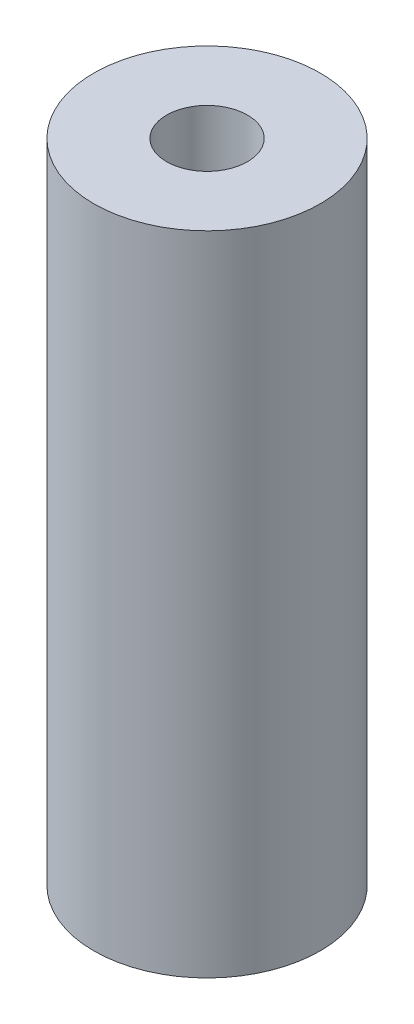
ISO-10303-21;
HEADER;
FILE_DESCRIPTION(('STEP AP214'),'2;1');
FILE_NAME('part.step','',(''),(''),'','','');
FILE_SCHEMA(('AUTOMOTIVE_DESIGN { 1 0 10303 214 1 1 1 1 }'));
ENDSEC;
DATA;
#1=APPLICATION_CONTEXT('core data for automotive mechanical design processes');
#2=APPLICATION_PROTOCOL_DEFINITION('international standard','automotive_design',2000,#1);
#3=PRODUCT_CONTEXT('',#1,'mechanical');
#4=PRODUCT('Part','Part','',(#3));
#5=PRODUCT_RELATED_PRODUCT_CATEGORY('part','',(#4));
#6=PRODUCT_DEFINITION_FORMATION('','',#4);
#7=PRODUCT_DEFINITION_CONTEXT('part definition',#1,'design');
#8=PRODUCT_DEFINITION('design','',#6,#7);
#9=PRODUCT_DEFINITION_SHAPE('','',#8);
#10=(LENGTH_UNIT() NAMED_UNIT(*) SI_UNIT(.MILLI.,.METRE.));
#11=(NAMED_UNIT(*) PLANE_ANGLE_UNIT() SI_UNIT($,.RADIAN.));
#12=(NAMED_UNIT(*) SI_UNIT($,.STERADIAN.) SOLID_ANGLE_UNIT());
#13=UNCERTAINTY_MEASURE_WITH_UNIT(LENGTH_MEASURE(1.E-05),#10,'distance_accuracy_value','');
#14=(GEOMETRIC_REPRESENTATION_CONTEXT(3) GLOBAL_UNCERTAINTY_ASSIGNED_CONTEXT((#13)) GLOBAL_UNIT_ASSIGNED_CONTEXT((#10,
#11,#12)) REPRESENTATION_CONTEXT('',''));
#15=CARTESIAN_POINT('',(0.,0.,0.));
#16=DIRECTION('',(0.,0.,1.));
#17=DIRECTION('',(1.,0.,0.));
#18=AXIS2_PLACEMENT_3D('',#15,#16,#17);
#19=CARTESIAN_POINT('',(0.,40.,0.));
#20=DIRECTION('',(0.,1.,0.));
#21=DIRECTION('',(0.,0.,1.));
#22=AXIS2_PLACEMENT_3D('',#19,#20,#21);
#23=PLANE('',#22);
#24=CARTESIAN_POINT('',(0.,40.,0.));
#25=DIRECTION('',(0.,1.,0.));
#26=DIRECTION('',(0.,0.,1.));
#27=AXIS2_PLACEMENT_3D('',#24,#25,#26);
#28=CIRCLE('',#27,7.);
#29=CARTESIAN_POINT('',(0.,40.,7.));
#30=VERTEX_POINT('',#29);
#31=EDGE_CURVE('E10',#30,#30,#28,.T.);
#32=ORIENTED_EDGE('',*,*,#31,.T.);
#33=EDGE_LOOP('',(#32));
#34=FACE_BOUND('',#33,.T.);
#35=CARTESIAN_POINT('',(0.,40.,0.));
#36=DIRECTION('',(0.,1.,0.));
#37=DIRECTION('',(0.,0.,1.));
#38=AXIS2_PLACEMENT_3D('',#35,#36,#37);
#39=CIRCLE('',#38,2.5);
#40=CARTESIAN_POINT('',(0.,40.,2.5));
#41=VERTEX_POINT('',#40);
#42=EDGE_CURVE('E50',#41,#41,#39,.T.);
#43=ORIENTED_EDGE('',*,*,#42,.F.);
#44=EDGE_LOOP('',(#43));
#45=FACE_BOUND('',#44,.T.);
#46=ADVANCED_FACE('F37',(#34,#45),#23,.T.);
#47=CARTESIAN_POINT('',(0.,0.,0.));
#48=DIRECTION('',(0.,1.,0.));
#49=DIRECTION('',(0.,0.,1.));
#50=AXIS2_PLACEMENT_3D('',#47,#48,#49);
#51=PLANE('',#50);
#52=CARTESIAN_POINT('',(0.,0.,0.));
#53=DIRECTION('',(0.,1.,0.));
#54=DIRECTION('',(0.,0.,1.));
#55=AXIS2_PLACEMENT_3D('',#52,#53,#54);
#56=CIRCLE('',#55,7.);
#57=CARTESIAN_POINT('',(0.,0.,7.));
#58=VERTEX_POINT('',#57);
#59=EDGE_CURVE('E41',#58,#58,#56,.T.);
#60=ORIENTED_EDGE('',*,*,#59,.F.);
#61=EDGE_LOOP('',(#60));
#62=FACE_BOUND('',#61,.T.);
#63=CARTESIAN_POINT('',(0.,0.,0.));
#64=DIRECTION('',(0.,1.,0.));
#65=DIRECTION('',(0.,0.,1.));
#66=AXIS2_PLACEMENT_3D('',#63,#64,#65);
#67=CIRCLE('',#66,2.5);
#68=CARTESIAN_POINT('',(0.,0.,2.5));
#69=VERTEX_POINT('',#68);
#70=EDGE_CURVE('E52',#69,#69,#67,.T.);
#71=ORIENTED_EDGE('',*,*,#70,.T.);
#72=EDGE_LOOP('',(#71));
#73=FACE_BOUND('',#72,.T.);
#74=ADVANCED_FACE('F64',(#62,#73),#51,.F.);
#75=CARTESIAN_POINT('',(0.,40.,0.));
#76=DIRECTION('',(0.,-1.,0.));
#77=DIRECTION('',(0.,0.,-1.));
#78=AXIS2_PLACEMENT_3D('',#75,#76,#77);
#79=CYLINDRICAL_SURFACE('',#78,7.);
#80=ORIENTED_EDGE('',*,*,#31,.F.);
#81=EDGE_LOOP('',(#80));
#82=FACE_BOUND('',#81,.T.);
#83=ORIENTED_EDGE('',*,*,#59,.T.);
#84=EDGE_LOOP('',(#83));
#85=FACE_BOUND('',#84,.T.);
#86=ADVANCED_FACE('F39',(#82,#85),#79,.T.);
#87=CARTESIAN_POINT('',(0.,40.,0.));
#88=DIRECTION('',(0.,-1.,0.));
#89=DIRECTION('',(0.,0.,-1.));
#90=AXIS2_PLACEMENT_3D('',#87,#88,#89);
#91=CYLINDRICAL_SURFACE('',#90,2.5);
#92=ORIENTED_EDGE('',*,*,#42,.T.);
#93=EDGE_LOOP('',(#92));
#94=FACE_BOUND('',#93,.T.);
#95=ORIENTED_EDGE('',*,*,#70,.F.);
#96=EDGE_LOOP('',(#95));
#97=FACE_BOUND('',#96,.T.);
#98=ADVANCED_FACE('F60',(#94,#97),#91,.F.);
#99=CLOSED_SHELL('',(#46,#74,#86,#98));
#100=MANIFOLD_SOLID_BREP('B2',#99);
#101=ADVANCED_BREP_SHAPE_REPRESENTATION('',(#18,#100),#14);
#102=SHAPE_DEFINITION_REPRESENTATION(#9,#101);
ENDSEC;
END-ISO-10303-21;
